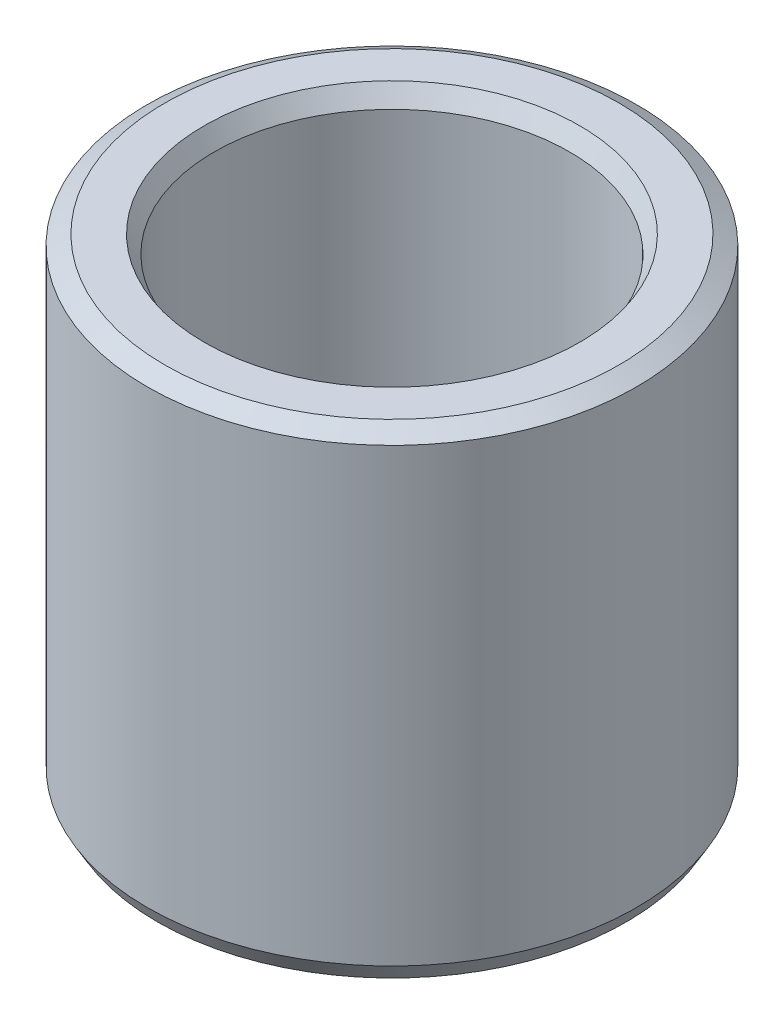
ISO-10303-21;
HEADER;
FILE_DESCRIPTION(('STEP AP214'),'2;1');
FILE_NAME('part.step','',(''),(''),'','','');
FILE_SCHEMA(('AUTOMOTIVE_DESIGN { 1 0 10303 214 1 1 1 1 }'));
ENDSEC;
DATA;
#1=APPLICATION_CONTEXT('core data for automotive mechanical design processes');
#2=APPLICATION_PROTOCOL_DEFINITION('international standard','automotive_design',2000,#1);
#3=PRODUCT_CONTEXT('',#1,'mechanical');
#4=PRODUCT('Part','Part','',(#3));
#5=PRODUCT_RELATED_PRODUCT_CATEGORY('part','',(#4));
#6=PRODUCT_DEFINITION_FORMATION('','',#4);
#7=PRODUCT_DEFINITION_CONTEXT('part definition',#1,'design');
#8=PRODUCT_DEFINITION('design','',#6,#7);
#9=PRODUCT_DEFINITION_SHAPE('','',#8);
#10=(LENGTH_UNIT() NAMED_UNIT(*) SI_UNIT(.MILLI.,.METRE.));
#11=(NAMED_UNIT(*) PLANE_ANGLE_UNIT() SI_UNIT($,.RADIAN.));
#12=(NAMED_UNIT(*) SI_UNIT($,.STERADIAN.) SOLID_ANGLE_UNIT());
#13=UNCERTAINTY_MEASURE_WITH_UNIT(LENGTH_MEASURE(1.E-05),#10,'distance_accuracy_value','');
#14=(GEOMETRIC_REPRESENTATION_CONTEXT(3) GLOBAL_UNCERTAINTY_ASSIGNED_CONTEXT((#13)) GLOBAL_UNIT_ASSIGNED_CONTEXT((#10,
#11,#12)) REPRESENTATION_CONTEXT('',''));
#15=CARTESIAN_POINT('',(0.,0.,0.));
#16=DIRECTION('',(0.,0.,1.));
#17=DIRECTION('',(1.,0.,0.));
#18=AXIS2_PLACEMENT_3D('',#15,#16,#17);
#19=CARTESIAN_POINT('',(0.,73.3779361402619,0.));
#20=DIRECTION('',(0.,-1.,0.));
#21=DIRECTION('',(0.,0.,-1.));
#22=AXIS2_PLACEMENT_3D('',#19,#20,#21);
#23=CYLINDRICAL_SURFACE('',#22,37.5);
#24=CARTESIAN_POINT('',(0.,2.69388097154762,0.));
#25=DIRECTION('',(0.,1.,0.));
#26=DIRECTION('',(0.,0.,1.));
#27=AXIS2_PLACEMENT_3D('',#24,#25,#26);
#28=CIRCLE('',#27,37.5);
#29=CARTESIAN_POINT('',(0.,2.69388097154762,37.5));
#30=VERTEX_POINT('',#29);
#31=EDGE_CURVE('E10',#30,#30,#28,.T.);
#32=ORIENTED_EDGE('',*,*,#31,.T.);
#33=EDGE_LOOP('',(#32));
#34=FACE_BOUND('',#33,.T.);
#35=CARTESIAN_POINT('',(0.,71.822623236174,0.));
#36=DIRECTION('',(0.,1.,0.));
#37=DIRECTION('',(0.,0.,1.));
#38=AXIS2_PLACEMENT_3D('',#35,#36,#37);
#39=CIRCLE('',#38,37.5);
#40=CARTESIAN_POINT('',(0.,71.822623236174,37.5));
#41=VERTEX_POINT('',#40);
#42=EDGE_CURVE('E50',#41,#41,#39,.F.);
#43=ORIENTED_EDGE('',*,*,#42,.T.);
#44=EDGE_LOOP('',(#43));
#45=FACE_BOUND('',#44,.T.);
#46=ADVANCED_FACE('F39',(#34,#45),#23,.T.);
#47=CARTESIAN_POINT('',(0.,73.3779361402619,0.));
#48=DIRECTION('',(0.,1.,0.));
#49=DIRECTION('',(0.,0.,1.));
#50=AXIS2_PLACEMENT_3D('',#47,#48,#49);
#51=PLANE('',#50);
#52=CARTESIAN_POINT('',(0.,73.3779361402619,0.));
#53=DIRECTION('',(0.,1.,0.));
#54=DIRECTION('',(0.,0.,1.));
#55=AXIS2_PLACEMENT_3D('',#52,#53,#54);
#56=CIRCLE('',#55,28.778067817125);
#57=CARTESIAN_POINT('',(0.,73.3779361402619,28.778067817125));
#58=VERTEX_POINT('',#57);
#59=EDGE_CURVE('E58',#58,#58,#56,.F.);
#60=ORIENTED_EDGE('',*,*,#59,.T.);
#61=EDGE_LOOP('',(#60));
#62=FACE_BOUND('',#61,.T.);
#63=CARTESIAN_POINT('',(0.,73.3779361402619,0.));
#64=DIRECTION('',(0.,1.,0.));
#65=DIRECTION('',(0.,0.,1.));
#66=AXIS2_PLACEMENT_3D('',#63,#64,#65);
#67=CIRCLE('',#66,34.8061190284524);
#68=CARTESIAN_POINT('',(0.,73.3779361402619,34.8061190284524));
#69=VERTEX_POINT('',#68);
#70=EDGE_CURVE('E61',#69,#69,#67,.T.);
#71=ORIENTED_EDGE('',*,*,#70,.T.);
#72=EDGE_LOOP('',(#71));
#73=FACE_BOUND('',#72,.T.);
#74=ADVANCED_FACE('F88',(#62,#73),#51,.T.);
#75=CARTESIAN_POINT('',(0.,0.,0.));
#76=DIRECTION('',(0.,1.,0.));
#77=DIRECTION('',(0.,0.,1.));
#78=AXIS2_PLACEMENT_3D('',#75,#76,#77);
#79=PLANE('',#78);
#80=CARTESIAN_POINT('',(0.,0.,0.));
#81=DIRECTION('',(0.,1.,0.));
#82=DIRECTION('',(0.,0.,1.));
#83=AXIS2_PLACEMENT_3D('',#80,#81,#82);
#84=CIRCLE('',#83,29.9166358845848);
#85=CARTESIAN_POINT('',(0.,0.,29.9166358845848));
#86=VERTEX_POINT('',#85);
#87=EDGE_CURVE('E51',#86,#86,#84,.T.);
#88=ORIENTED_EDGE('',*,*,#87,.T.);
#89=EDGE_LOOP('',(#88));
#90=FACE_BOUND('',#89,.T.);
#91=CARTESIAN_POINT('',(0.,0.,0.));
#92=DIRECTION('',(0.,1.,0.));
#93=DIRECTION('',(0.,0.,1.));
#94=AXIS2_PLACEMENT_3D('',#91,#92,#93);
#95=CIRCLE('',#94,35.9446870959122);
#96=CARTESIAN_POINT('',(0.,0.,35.9446870959122));
#97=VERTEX_POINT('',#96);
#98=EDGE_CURVE('E54',#97,#97,#95,.F.);
#99=ORIENTED_EDGE('',*,*,#98,.T.);
#100=EDGE_LOOP('',(#99));
#101=FACE_BOUND('',#100,.T.);
#102=ADVANCED_FACE('F83',(#90,#101),#79,.F.);
#103=CARTESIAN_POINT('',(0.,73.3779361402619,0.));
#104=DIRECTION('',(0.,-1.,0.));
#105=DIRECTION('',(0.,0.,-1.));
#106=AXIS2_PLACEMENT_3D('',#103,#104,#105);
#107=CYLINDRICAL_SURFACE('',#106,27.2227549130372);
#108=CARTESIAN_POINT('',(0.,70.6840551687142,0.));
#109=DIRECTION('',(0.,1.,0.));
#110=DIRECTION('',(0.,0.,1.));
#111=AXIS2_PLACEMENT_3D('',#108,#109,#110);
#112=CIRCLE('',#111,27.2227549130372);
#113=CARTESIAN_POINT('',(0.,70.6840551687142,27.2227549130372));
#114=VERTEX_POINT('',#113);
#115=EDGE_CURVE('E67',#114,#114,#112,.T.);
#116=ORIENTED_EDGE('',*,*,#115,.T.);
#117=EDGE_LOOP('',(#116));
#118=FACE_BOUND('',#117,.T.);
#119=CARTESIAN_POINT('',(0.,1.55531290408788,0.));
#120=DIRECTION('',(0.,1.,0.));
#121=DIRECTION('',(0.,0.,1.));
#122=AXIS2_PLACEMENT_3D('',#119,#120,#121);
#123=CIRCLE('',#122,27.2227549130372);
#124=CARTESIAN_POINT('',(0.,1.55531290408788,27.2227549130372));
#125=VERTEX_POINT('',#124);
#126=EDGE_CURVE('E69',#125,#125,#123,.F.);
#127=ORIENTED_EDGE('',*,*,#126,.T.);
#128=EDGE_LOOP('',(#127));
#129=FACE_BOUND('',#128,.T.);
#130=ADVANCED_FACE('F71',(#118,#129),#107,.F.);
#131=CARTESIAN_POINT('',(0.,70.6840551687142,0.));
#132=DIRECTION('',(0.,1.,0.));
#133=DIRECTION('',(0.,0.,1.));
#134=AXIS2_PLACEMENT_3D('',#131,#132,#133);
#135=CONICAL_SURFACE('',#134,27.2227549130372,0.523598775598297);
#136=ORIENTED_EDGE('',*,*,#59,.F.);
#137=EDGE_LOOP('',(#136));
#138=FACE_BOUND('',#137,.T.);
#139=ORIENTED_EDGE('',*,*,#115,.F.);
#140=EDGE_LOOP('',(#139));
#141=FACE_BOUND('',#140,.T.);
#142=ADVANCED_FACE('F77',(#138,#141),#135,.F.);
#143=CARTESIAN_POINT('',(0.,0.,0.));
#144=DIRECTION('',(0.,-1.,0.));
#145=DIRECTION('',(0.,0.,-1.));
#146=AXIS2_PLACEMENT_3D('',#143,#144,#145);
#147=CONICAL_SURFACE('',#146,29.9166358845848,1.04719755119659);
#148=ORIENTED_EDGE('',*,*,#126,.F.);
#149=EDGE_LOOP('',(#148));
#150=FACE_BOUND('',#149,.T.);
#151=ORIENTED_EDGE('',*,*,#87,.F.);
#152=EDGE_LOOP('',(#151));
#153=FACE_BOUND('',#152,.T.);
#154=ADVANCED_FACE('F73',(#150,#153),#147,.F.);
#155=CARTESIAN_POINT('',(0.,2.69388097154762,0.));
#156=DIRECTION('',(0.,1.,0.));
#157=DIRECTION('',(0.,0.,1.));
#158=AXIS2_PLACEMENT_3D('',#155,#156,#157);
#159=CONICAL_SURFACE('',#158,37.5,0.523598775598301);
#160=ORIENTED_EDGE('',*,*,#98,.F.);
#161=EDGE_LOOP('',(#160));
#162=FACE_BOUND('',#161,.T.);
#163=ORIENTED_EDGE('',*,*,#31,.F.);
#164=EDGE_LOOP('',(#163));
#165=FACE_BOUND('',#164,.T.);
#166=ADVANCED_FACE('F76',(#162,#165),#159,.T.);
#167=CARTESIAN_POINT('',(0.,73.3779361402619,0.));
#168=DIRECTION('',(0.,-1.,0.));
#169=DIRECTION('',(0.,0.,-1.));
#170=AXIS2_PLACEMENT_3D('',#167,#168,#169);
#171=CONICAL_SURFACE('',#170,34.8061190284524,1.04719755119659);
#172=ORIENTED_EDGE('',*,*,#42,.F.);
#173=EDGE_LOOP('',(#172));
#174=FACE_BOUND('',#173,.T.);
#175=ORIENTED_EDGE('',*,*,#70,.F.);
#176=EDGE_LOOP('',(#175));
#177=FACE_BOUND('',#176,.T.);
#178=ADVANCED_FACE('F45',(#174,#177),#171,.T.);
#179=CLOSED_SHELL('',(#46,#74,#102,#130,#142,#154,#166,#178));
#180=MANIFOLD_SOLID_BREP('B2',#179);
#181=ADVANCED_BREP_SHAPE_REPRESENTATION('',(#18,#180),#14);
#182=SHAPE_DEFINITION_REPRESENTATION(#9,#181);
ENDSEC;
END-ISO-10303-21;
